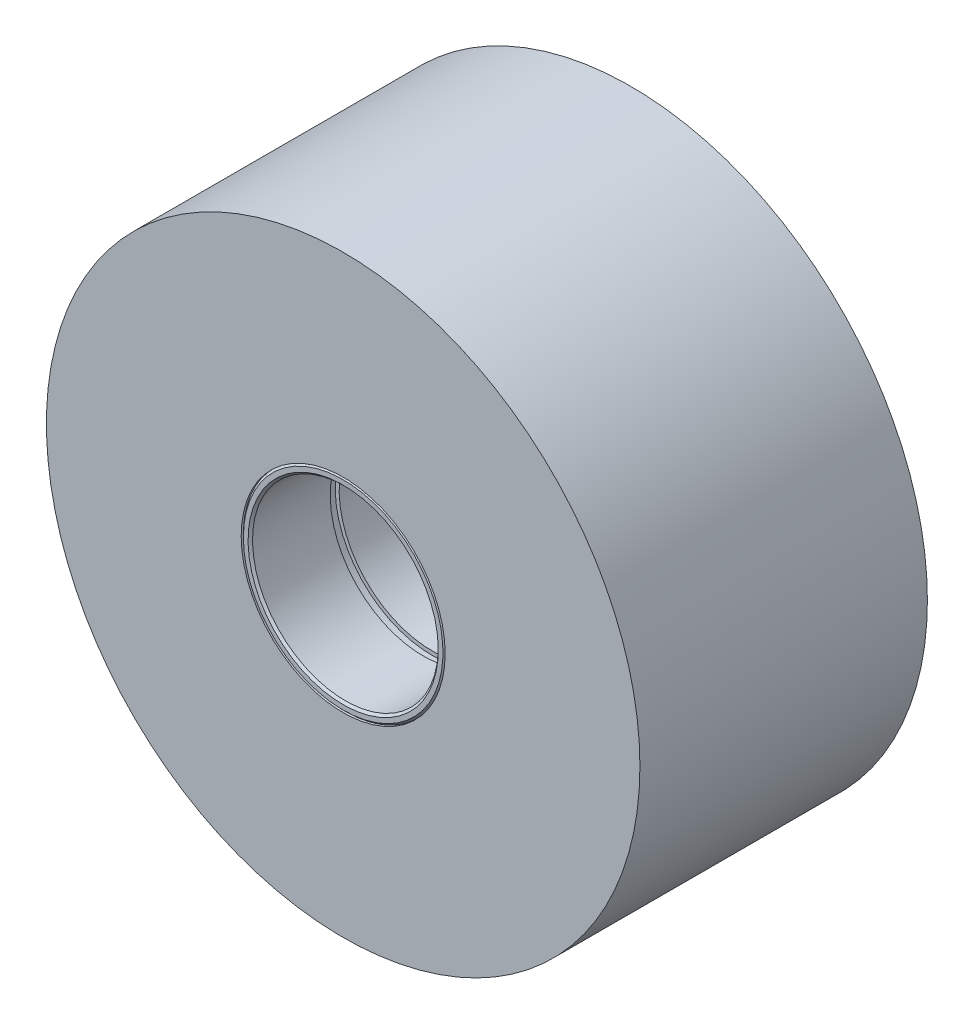
ISO-10303-21;
HEADER;
FILE_DESCRIPTION(('STEP AP214'),'2;1');
FILE_NAME('part.step','',(''),(''),'','','');
FILE_SCHEMA(('AUTOMOTIVE_DESIGN { 1 0 10303 214 1 1 1 1 }'));
ENDSEC;
DATA;
#1=APPLICATION_CONTEXT('core data for automotive mechanical design processes');
#2=APPLICATION_PROTOCOL_DEFINITION('international standard','automotive_design',2000,#1);
#3=PRODUCT_CONTEXT('',#1,'mechanical');
#4=PRODUCT('Part','Part','',(#3));
#5=PRODUCT_RELATED_PRODUCT_CATEGORY('part','',(#4));
#6=PRODUCT_DEFINITION_FORMATION('','',#4);
#7=PRODUCT_DEFINITION_CONTEXT('part definition',#1,'design');
#8=PRODUCT_DEFINITION('design','',#6,#7);
#9=PRODUCT_DEFINITION_SHAPE('','',#8);
#10=(LENGTH_UNIT() NAMED_UNIT(*) SI_UNIT(.MILLI.,.METRE.));
#11=(NAMED_UNIT(*) PLANE_ANGLE_UNIT() SI_UNIT($,.RADIAN.));
#12=(NAMED_UNIT(*) SI_UNIT($,.STERADIAN.) SOLID_ANGLE_UNIT());
#13=UNCERTAINTY_MEASURE_WITH_UNIT(LENGTH_MEASURE(1.E-05),#10,'distance_accuracy_value','');
#14=(GEOMETRIC_REPRESENTATION_CONTEXT(3) GLOBAL_UNCERTAINTY_ASSIGNED_CONTEXT((#13)) GLOBAL_UNIT_ASSIGNED_CONTEXT((#10,
#11,#12)) REPRESENTATION_CONTEXT('',''));
#15=CARTESIAN_POINT('',(0.,0.,0.));
#16=DIRECTION('',(0.,0.,1.));
#17=DIRECTION('',(1.,0.,0.));
#18=AXIS2_PLACEMENT_3D('',#15,#16,#17);
#19=CARTESIAN_POINT('',(0.,0.,0.));
#20=DIRECTION('',(0.,0.,-1.));
#21=DIRECTION('',(-1.,0.,0.));
#22=AXIS2_PLACEMENT_3D('',#19,#20,#21);
#23=CYLINDRICAL_SURFACE('',#22,17.4625);
#24=CARTESIAN_POINT('',(0.,0.,-49.2125));
#25=DIRECTION('',(0.,0.,-1.));
#26=DIRECTION('',(-1.,0.,0.));
#27=AXIS2_PLACEMENT_3D('',#24,#25,#26);
#28=CIRCLE('',#27,17.4625);
#29=CARTESIAN_POINT('',(-17.4625,0.,-49.2125));
#30=VERTEX_POINT('',#29);
#31=EDGE_CURVE('P0_E17',#30,#30,#28,.T.);
#32=ORIENTED_EDGE('',*,*,#31,.T.);
#33=EDGE_LOOP('',(#32));
#34=FACE_BOUND('',#33,.T.);
#35=CARTESIAN_POINT('',(0.,0.,0.));
#36=DIRECTION('',(0.,0.,-1.));
#37=DIRECTION('',(-1.,0.,0.));
#38=AXIS2_PLACEMENT_3D('',#35,#36,#37);
#39=CIRCLE('',#38,17.4625);
#40=CARTESIAN_POINT('',(-17.4625,0.,0.));
#41=VERTEX_POINT('',#40);
#42=EDGE_CURVE('P0_E26',#41,#41,#39,.T.);
#43=ORIENTED_EDGE('',*,*,#42,.F.);
#44=EDGE_LOOP('',(#43));
#45=FACE_BOUND('',#44,.T.);
#46=ADVANCED_FACE('P0_F14',(#34,#45),#23,.F.);
#47=CARTESIAN_POINT('',(0.,0.,-49.2125));
#48=DIRECTION('',(0.,0.,1.));
#49=DIRECTION('',(1.,0.,0.));
#50=AXIS2_PLACEMENT_3D('',#47,#48,#49);
#51=PLANE('',#50);
#52=CARTESIAN_POINT('',(0.,0.,-49.2125));
#53=DIRECTION('',(0.,0.,1.));
#54=DIRECTION('',(1.,0.,0.));
#55=AXIS2_PLACEMENT_3D('',#52,#53,#54);
#56=CIRCLE('',#55,50.8);
#57=CARTESIAN_POINT('',(50.8,0.,-49.2125));
#58=VERTEX_POINT('',#57);
#59=EDGE_CURVE('P0_E21',#58,#58,#56,.T.);
#60=ORIENTED_EDGE('',*,*,#59,.F.);
#61=EDGE_LOOP('',(#60));
#62=FACE_BOUND('',#61,.T.);
#63=ORIENTED_EDGE('',*,*,#31,.F.);
#64=EDGE_LOOP('',(#63));
#65=FACE_BOUND('',#64,.T.);
#66=ADVANCED_FACE('P0_F36',(#62,#65),#51,.F.);
#67=CARTESIAN_POINT('',(0.,0.,0.));
#68=DIRECTION('',(0.,0.,1.));
#69=DIRECTION('',(1.,0.,0.));
#70=AXIS2_PLACEMENT_3D('',#67,#68,#69);
#71=PLANE('',#70);
#72=CARTESIAN_POINT('',(0.,0.,0.));
#73=DIRECTION('',(0.,0.,1.));
#74=DIRECTION('',(1.,0.,0.));
#75=AXIS2_PLACEMENT_3D('',#72,#73,#74);
#76=CIRCLE('',#75,50.8);
#77=CARTESIAN_POINT('',(50.8,0.,0.));
#78=VERTEX_POINT('',#77);
#79=EDGE_CURVE('P0_E10',#78,#78,#76,.F.);
#80=ORIENTED_EDGE('',*,*,#79,.F.);
#81=EDGE_LOOP('',(#80));
#82=FACE_BOUND('',#81,.T.);
#83=ORIENTED_EDGE('',*,*,#42,.T.);
#84=EDGE_LOOP('',(#83));
#85=FACE_BOUND('',#84,.T.);
#86=ADVANCED_FACE('P0_F38',(#82,#85),#71,.T.);
#87=CARTESIAN_POINT('',(0.,0.,-49.2125));
#88=DIRECTION('',(0.,0.,1.));
#89=DIRECTION('',(1.,0.,0.));
#90=AXIS2_PLACEMENT_3D('',#87,#88,#89);
#91=CYLINDRICAL_SURFACE('',#90,50.8);
#92=ORIENTED_EDGE('',*,*,#79,.T.);
#93=EDGE_LOOP('',(#92));
#94=FACE_BOUND('',#93,.T.);
#95=ORIENTED_EDGE('',*,*,#59,.T.);
#96=EDGE_LOOP('',(#95));
#97=FACE_BOUND('',#96,.T.);
#98=ADVANCED_FACE('P0_F45',(#94,#97),#91,.T.);
#99=CLOSED_SHELL('',(#46,#66,#86,#98));
#100=MANIFOLD_SOLID_BREP('P0_B1',#99);
#101=CARTESIAN_POINT('',(0.,0.,-49.2125));
#102=DIRECTION('',(0.,0.,1.));
#103=DIRECTION('',(-0.923728021347068,-0.383049008063238,0.));
#104=AXIS2_PLACEMENT_3D('',#101,#102,#103);
#105=CYLINDRICAL_SURFACE('',#104,15.9004);
#106=CARTESIAN_POINT('',(0.,0.,-15.20825));
#107=DIRECTION('',(0.,0.,1.));
#108=DIRECTION('',(-0.923728021347068,-0.383049008063238,0.));
#109=AXIS2_PLACEMENT_3D('',#106,#107,#108);
#110=CIRCLE('',#109,15.9004);
#111=CARTESIAN_POINT('',(-14.6876450306269,-6.0906324478087,-15.20825));
#112=VERTEX_POINT('',#111);
#113=EDGE_CURVE('P1_E63',#112,#112,#110,.T.);
#114=ORIENTED_EDGE('',*,*,#113,.T.);
#115=EDGE_LOOP('',(#114));
#116=FACE_BOUND('',#115,.T.);
#117=CARTESIAN_POINT('',(0.,0.,-34.00425));
#118=DIRECTION('',(0.,0.,1.));
#119=DIRECTION('',(-0.923728021347068,-0.383049008063238,0.));
#120=AXIS2_PLACEMENT_3D('',#117,#118,#119);
#121=CIRCLE('',#120,15.9004);
#122=CARTESIAN_POINT('',(-14.6876450306269,-6.0906324478087,-34.00425));
#123=VERTEX_POINT('',#122);
#124=EDGE_CURVE('P1_E17',#123,#123,#121,.T.);
#125=ORIENTED_EDGE('',*,*,#124,.F.);
#126=EDGE_LOOP('',(#125));
#127=FACE_BOUND('',#126,.T.);
#128=ADVANCED_FACE('P1_F14',(#116,#127),#105,.F.);
#129=CARTESIAN_POINT('',(0.,0.,-34.00425));
#130=DIRECTION('',(0.,0.,-1.));
#131=DIRECTION('',(0.923728021347068,0.383049008063238,0.));
#132=AXIS2_PLACEMENT_3D('',#129,#130,#131);
#133=PLANE('',#132);
#134=CARTESIAN_POINT('',(0.,0.,-34.00425));
#135=DIRECTION('',(0.,0.,1.));
#136=DIRECTION('',(-0.923728021347068,-0.383049008063238,0.));
#137=AXIS2_PLACEMENT_3D('',#134,#135,#136);
#138=CIRCLE('',#137,16.5735);
#139=CARTESIAN_POINT('',(-15.3094063617956,-6.34846273513607,-34.00425));
#140=VERTEX_POINT('',#139);
#141=EDGE_CURVE('P1_E61',#140,#140,#138,.F.);
#142=ORIENTED_EDGE('',*,*,#141,.T.);
#143=EDGE_LOOP('',(#142));
#144=FACE_BOUND('',#143,.T.);
#145=ORIENTED_EDGE('',*,*,#124,.T.);
#146=EDGE_LOOP('',(#145));
#147=FACE_BOUND('',#146,.T.);
#148=ADVANCED_FACE('P1_F70',(#144,#147),#133,.T.);
#149=CARTESIAN_POINT('',(0.,0.,-15.20825));
#150=DIRECTION('',(0.,0.,-1.));
#151=DIRECTION('',(0.923728021347068,0.383049008063238,0.));
#152=AXIS2_PLACEMENT_3D('',#149,#150,#151);
#153=PLANE('',#152);
#154=CARTESIAN_POINT('',(0.,0.,-15.20825));
#155=DIRECTION('',(0.,0.,-1.));
#156=DIRECTION('',(0.923728021347068,0.383049008063238,0.));
#157=AXIS2_PLACEMENT_3D('',#154,#155,#156);
#158=CIRCLE('',#157,16.5735);
#159=CARTESIAN_POINT('',(15.3094063617956,6.34846273513607,-15.20825));
#160=VERTEX_POINT('',#159);
#161=EDGE_CURVE('P1_E58',#160,#160,#158,.F.);
#162=ORIENTED_EDGE('',*,*,#161,.T.);
#163=EDGE_LOOP('',(#162));
#164=FACE_BOUND('',#163,.T.);
#165=ORIENTED_EDGE('',*,*,#113,.F.);
#166=EDGE_LOOP('',(#165));
#167=FACE_BOUND('',#166,.T.);
#168=ADVANCED_FACE('P1_F77',(#164,#167),#153,.F.);
#169=CARTESIAN_POINT('',(0.,0.,-35.52825));
#170=DIRECTION('',(0.,0.,1.));
#171=DIRECTION('',(-0.923728021347068,-0.383049008063238,0.));
#172=AXIS2_PLACEMENT_3D('',#169,#170,#171);
#173=CYLINDRICAL_SURFACE('',#172,16.5735);
#174=ORIENTED_EDGE('',*,*,#141,.F.);
#175=EDGE_LOOP('',(#174));
#176=FACE_BOUND('',#175,.T.);
#177=CARTESIAN_POINT('',(0.,0.,-35.52825));
#178=DIRECTION('',(0.,0.,1.));
#179=DIRECTION('',(-0.923728021347068,-0.383049008063238,0.));
#180=AXIS2_PLACEMENT_3D('',#177,#178,#179);
#181=CIRCLE('',#180,16.5735);
#182=CARTESIAN_POINT('',(-15.3094063617956,-6.34846273513607,-35.52825));
#183=VERTEX_POINT('',#182);
#184=EDGE_CURVE('P1_E55',#183,#183,#181,.F.);
#185=ORIENTED_EDGE('',*,*,#184,.T.);
#186=EDGE_LOOP('',(#185));
#187=FACE_BOUND('',#186,.T.);
#188=ADVANCED_FACE('P1_F129',(#176,#187),#173,.F.);
#189=CARTESIAN_POINT('',(0.,0.,-13.68425));
#190=DIRECTION('',(0.,0.,-1.));
#191=DIRECTION('',(0.923728021347068,0.383049008063238,0.));
#192=AXIS2_PLACEMENT_3D('',#189,#190,#191);
#193=CYLINDRICAL_SURFACE('',#192,16.5735);
#194=ORIENTED_EDGE('',*,*,#161,.F.);
#195=EDGE_LOOP('',(#194));
#196=FACE_BOUND('',#195,.T.);
#197=CARTESIAN_POINT('',(0.,0.,-13.68425));
#198=DIRECTION('',(0.,0.,-1.));
#199=DIRECTION('',(0.923728021347068,0.383049008063238,0.));
#200=AXIS2_PLACEMENT_3D('',#197,#198,#199);
#201=CIRCLE('',#200,16.5735);
#202=CARTESIAN_POINT('',(15.3094063617956,6.34846273513607,-13.68425));
#203=VERTEX_POINT('',#202);
#204=EDGE_CURVE('P1_E52',#203,#203,#201,.T.);
#205=ORIENTED_EDGE('',*,*,#204,.F.);
#206=EDGE_LOOP('',(#205));
#207=FACE_BOUND('',#206,.T.);
#208=ADVANCED_FACE('P1_F125',(#196,#207),#193,.F.);
#209=CARTESIAN_POINT('',(0.,0.,-35.52825));
#210=DIRECTION('',(0.,0.,-1.));
#211=DIRECTION('',(0.923728021347068,0.383049008063238,0.));
#212=AXIS2_PLACEMENT_3D('',#209,#210,#211);
#213=PLANE('',#212);
#214=ORIENTED_EDGE('',*,*,#184,.F.);
#215=EDGE_LOOP('',(#214));
#216=FACE_BOUND('',#215,.T.);
#217=CARTESIAN_POINT('',(0.,0.,-35.52825));
#218=DIRECTION('',(0.,0.,1.));
#219=DIRECTION('',(-0.923728021347068,-0.383049008063238,0.));
#220=AXIS2_PLACEMENT_3D('',#217,#218,#219);
#221=CIRCLE('',#220,15.9004);
#222=CARTESIAN_POINT('',(-14.6876450306269,-6.0906324478087,-35.52825));
#223=VERTEX_POINT('',#222);
#224=EDGE_CURVE('P1_E49',#223,#223,#221,.F.);
#225=ORIENTED_EDGE('',*,*,#224,.T.);
#226=EDGE_LOOP('',(#225));
#227=FACE_BOUND('',#226,.T.);
#228=ADVANCED_FACE('P1_F121',(#216,#227),#213,.F.);
#229=CARTESIAN_POINT('',(0.,0.,-13.68425));
#230=DIRECTION('',(0.,0.,-1.));
#231=DIRECTION('',(0.923728021347068,0.383049008063238,0.));
#232=AXIS2_PLACEMENT_3D('',#229,#230,#231);
#233=PLANE('',#232);
#234=ORIENTED_EDGE('',*,*,#204,.T.);
#235=EDGE_LOOP('',(#234));
#236=FACE_BOUND('',#235,.T.);
#237=CARTESIAN_POINT('',(0.,0.,-13.68425));
#238=DIRECTION('',(0.,0.,1.));
#239=DIRECTION('',(-0.923728021347068,-0.383049008063238,0.));
#240=AXIS2_PLACEMENT_3D('',#237,#238,#239);
#241=CIRCLE('',#240,15.9004);
#242=CARTESIAN_POINT('',(-14.6876450306269,-6.0906324478087,-13.68425));
#243=VERTEX_POINT('',#242);
#244=EDGE_CURVE('P1_E36',#243,#243,#241,.T.);
#245=ORIENTED_EDGE('',*,*,#244,.T.);
#246=EDGE_LOOP('',(#245));
#247=FACE_BOUND('',#246,.T.);
#248=ADVANCED_FACE('P1_F117',(#236,#247),#233,.T.);
#249=CARTESIAN_POINT('',(0.,0.,-49.2125));
#250=DIRECTION('',(0.,0.,1.));
#251=DIRECTION('',(-0.923728021347068,-0.383049008063238,0.));
#252=AXIS2_PLACEMENT_3D('',#249,#250,#251);
#253=CYLINDRICAL_SURFACE('',#252,15.9004);
#254=CARTESIAN_POINT('',(0.,0.,-48.8315));
#255=DIRECTION('',(0.,0.,-1.));
#256=DIRECTION('',(0.923728021347068,0.383049008063238,0.));
#257=AXIS2_PLACEMENT_3D('',#254,#255,#256);
#258=CIRCLE('',#257,15.9004);
#259=CARTESIAN_POINT('',(14.6876450306269,6.0906324478087,-48.8315));
#260=VERTEX_POINT('',#259);
#261=EDGE_CURVE('P1_E33',#260,#260,#258,.T.);
#262=ORIENTED_EDGE('',*,*,#261,.T.);
#263=EDGE_LOOP('',(#262));
#264=FACE_BOUND('',#263,.T.);
#265=ORIENTED_EDGE('',*,*,#224,.F.);
#266=EDGE_LOOP('',(#265));
#267=FACE_BOUND('',#266,.T.);
#268=ADVANCED_FACE('P1_F113',(#264,#267),#253,.F.);
#269=CARTESIAN_POINT('',(0.,0.,-49.2125));
#270=DIRECTION('',(0.,0.,1.));
#271=DIRECTION('',(-0.923728021347068,-0.383049008063238,0.));
#272=AXIS2_PLACEMENT_3D('',#269,#270,#271);
#273=CYLINDRICAL_SURFACE('',#272,15.9004);
#274=CARTESIAN_POINT('',(0.,0.,-0.381000000000006));
#275=DIRECTION('',(0.,0.,1.));
#276=DIRECTION('',(-0.923728021347068,-0.383049008063238,0.));
#277=AXIS2_PLACEMENT_3D('',#274,#275,#276);
#278=CIRCLE('',#277,15.9004);
#279=CARTESIAN_POINT('',(-14.6876450306269,-6.0906324478087,-0.381000000000006));
#280=VERTEX_POINT('',#279);
#281=EDGE_CURVE('P1_E29',#280,#280,#278,.T.);
#282=ORIENTED_EDGE('',*,*,#281,.T.);
#283=EDGE_LOOP('',(#282));
#284=FACE_BOUND('',#283,.T.);
#285=ORIENTED_EDGE('',*,*,#244,.F.);
#286=EDGE_LOOP('',(#285));
#287=FACE_BOUND('',#286,.T.);
#288=ADVANCED_FACE('P1_F109',(#284,#287),#273,.F.);
#289=CARTESIAN_POINT('',(0.,0.,-49.2125));
#290=DIRECTION('',(0.,0.,-1.));
#291=DIRECTION('',(-0.383049008063238,0.923728021347068,0.));
#292=AXIS2_PLACEMENT_3D('',#289,#290,#291);
#293=CONICAL_SURFACE('',#292,16.2814,0.785398163397444);
#294=ORIENTED_EDGE('',*,*,#261,.F.);
#295=EDGE_LOOP('',(#294));
#296=FACE_BOUND('',#295,.T.);
#297=CARTESIAN_POINT('',(0.,0.,-49.2125));
#298=DIRECTION('',(0.,0.,-1.));
#299=DIRECTION('',(-0.383049008063238,0.923728021347068,0.));
#300=AXIS2_PLACEMENT_3D('',#297,#298,#299);
#301=CIRCLE('',#300,16.2814);
#302=CARTESIAN_POINT('',(-6.2365741198808,15.0395854067602,-49.2125));
#303=VERTEX_POINT('',#302);
#304=EDGE_CURVE('P1_E32',#303,#303,#301,.F.);
#305=ORIENTED_EDGE('',*,*,#304,.F.);
#306=EDGE_LOOP('',(#305));
#307=FACE_BOUND('',#306,.T.);
#308=ADVANCED_FACE('P1_F105',(#296,#307),#293,.F.);
#309=CARTESIAN_POINT('',(0.,0.,0.));
#310=DIRECTION('',(0.,0.,1.));
#311=DIRECTION('',(-0.923728021347068,-0.383049008063238,0.));
#312=AXIS2_PLACEMENT_3D('',#309,#310,#311);
#313=CONICAL_SURFACE('',#312,16.2814,0.785398163397444);
#314=CARTESIAN_POINT('',(0.,0.,0.));
#315=DIRECTION('',(0.,0.,1.));
#316=DIRECTION('',(-0.923728021347068,-0.383049008063238,0.));
#317=AXIS2_PLACEMENT_3D('',#314,#315,#316);
#318=CIRCLE('',#317,16.2814);
#319=CARTESIAN_POINT('',(-15.0395854067602,-6.2365741198808,0.));
#320=VERTEX_POINT('',#319);
#321=EDGE_CURVE('P1_E42',#320,#320,#318,.T.);
#322=ORIENTED_EDGE('',*,*,#321,.T.);
#323=EDGE_LOOP('',(#322));
#324=FACE_BOUND('',#323,.T.);
#325=ORIENTED_EDGE('',*,*,#281,.F.);
#326=EDGE_LOOP('',(#325));
#327=FACE_BOUND('',#326,.T.);
#328=ADVANCED_FACE('P1_F101',(#324,#327),#313,.F.);
#329=CARTESIAN_POINT('',(0.,0.,-49.2125));
#330=DIRECTION('',(0.,0.,-1.));
#331=DIRECTION('',(0.923728021347068,0.383049008063238,0.));
#332=AXIS2_PLACEMENT_3D('',#329,#330,#331);
#333=PLANE('',#332);
#334=CARTESIAN_POINT('',(0.,0.,-49.2125));
#335=DIRECTION('',(0.,0.,1.));
#336=DIRECTION('',(0.383049008063238,-0.923728021347068,0.));
#337=AXIS2_PLACEMENT_3D('',#334,#335,#336);
#338=CIRCLE('',#337,17.0815);
#339=CARTESIAN_POINT('',(6.54305163123219,-15.7786601966399,-49.2125));
#340=VERTEX_POINT('',#339);
#341=EDGE_CURVE('P1_E39',#340,#340,#338,.T.);
#342=ORIENTED_EDGE('',*,*,#341,.F.);
#343=EDGE_LOOP('',(#342));
#344=FACE_BOUND('',#343,.T.);
#345=ORIENTED_EDGE('',*,*,#304,.T.);
#346=EDGE_LOOP('',(#345));
#347=FACE_BOUND('',#346,.T.);
#348=ADVANCED_FACE('P1_F97',(#344,#347),#333,.T.);
#349=CARTESIAN_POINT('',(0.,0.,0.));
#350=DIRECTION('',(0.,0.,-1.));
#351=DIRECTION('',(0.923728021347068,0.383049008063238,0.));
#352=AXIS2_PLACEMENT_3D('',#349,#350,#351);
#353=PLANE('',#352);
#354=CARTESIAN_POINT('',(0.,0.,0.));
#355=DIRECTION('',(0.,0.,-1.));
#356=DIRECTION('',(-0.383049008063238,0.923728021347068,0.));
#357=AXIS2_PLACEMENT_3D('',#354,#355,#356);
#358=CIRCLE('',#357,17.0815);
#359=CARTESIAN_POINT('',(-6.54305163123219,15.7786601966399,0.));
#360=VERTEX_POINT('',#359);
#361=EDGE_CURVE('P1_E26',#360,#360,#358,.T.);
#362=ORIENTED_EDGE('',*,*,#361,.F.);
#363=EDGE_LOOP('',(#362));
#364=FACE_BOUND('',#363,.T.);
#365=ORIENTED_EDGE('',*,*,#321,.F.);
#366=EDGE_LOOP('',(#365));
#367=FACE_BOUND('',#366,.T.);
#368=ADVANCED_FACE('P1_F93',(#364,#367),#353,.F.);
#369=CARTESIAN_POINT('',(0.,0.,-48.8315));
#370=DIRECTION('',(0.,0.,1.));
#371=DIRECTION('',(0.383049008063238,-0.923728021347068,0.));
#372=AXIS2_PLACEMENT_3D('',#369,#370,#371);
#373=CONICAL_SURFACE('',#372,17.4625,0.785398163397444);
#374=CARTESIAN_POINT('',(0.,0.,-48.8315));
#375=DIRECTION('',(0.,0.,1.));
#376=DIRECTION('',(-0.923728021347068,-0.383049008063238,0.));
#377=AXIS2_PLACEMENT_3D('',#374,#375,#376);
#378=CIRCLE('',#377,17.4625);
#379=CARTESIAN_POINT('',(-16.1306005727732,-6.68899330330429,-48.8315));
#380=VERTEX_POINT('',#379);
#381=EDGE_CURVE('P1_E21',#380,#380,#378,.T.);
#382=ORIENTED_EDGE('',*,*,#381,.F.);
#383=EDGE_LOOP('',(#382));
#384=FACE_BOUND('',#383,.T.);
#385=ORIENTED_EDGE('',*,*,#341,.T.);
#386=EDGE_LOOP('',(#385));
#387=FACE_BOUND('',#386,.T.);
#388=ADVANCED_FACE('P1_F86',(#384,#387),#373,.T.);
#389=CARTESIAN_POINT('',(0.,0.,-0.381000000000006));
#390=DIRECTION('',(0.,0.,-1.));
#391=DIRECTION('',(-0.383049008063238,0.923728021347068,0.));
#392=AXIS2_PLACEMENT_3D('',#389,#390,#391);
#393=CONICAL_SURFACE('',#392,17.4625,0.785398163397444);
#394=CARTESIAN_POINT('',(0.,0.,-0.381000000000006));
#395=DIRECTION('',(0.,0.,1.));
#396=DIRECTION('',(-0.923728021347068,-0.383049008063238,0.));
#397=AXIS2_PLACEMENT_3D('',#394,#395,#396);
#398=CIRCLE('',#397,17.4625);
#399=CARTESIAN_POINT('',(-16.1306005727732,-6.68899330330429,-0.381000000000006));
#400=VERTEX_POINT('',#399);
#401=EDGE_CURVE('P1_E10',#400,#400,#398,.F.);
#402=ORIENTED_EDGE('',*,*,#401,.F.);
#403=EDGE_LOOP('',(#402));
#404=FACE_BOUND('',#403,.T.);
#405=ORIENTED_EDGE('',*,*,#361,.T.);
#406=EDGE_LOOP('',(#405));
#407=FACE_BOUND('',#406,.T.);
#408=ADVANCED_FACE('P1_F81',(#404,#407),#393,.T.);
#409=CARTESIAN_POINT('',(0.,0.,-49.2125));
#410=DIRECTION('',(0.,0.,1.));
#411=DIRECTION('',(-0.923728021347068,-0.383049008063238,0.));
#412=AXIS2_PLACEMENT_3D('',#409,#410,#411);
#413=CYLINDRICAL_SURFACE('',#412,17.4625);
#414=ORIENTED_EDGE('',*,*,#401,.T.);
#415=EDGE_LOOP('',(#414));
#416=FACE_BOUND('',#415,.T.);
#417=ORIENTED_EDGE('',*,*,#381,.T.);
#418=EDGE_LOOP('',(#417));
#419=FACE_BOUND('',#418,.T.);
#420=ADVANCED_FACE('P1_F79',(#416,#419),#413,.T.);
#421=CLOSED_SHELL('',(#128,#148,#168,#188,#208,#228,#248,#268,#288,#308,#328,#348,#368,#388,
#408,#420));
#422=MANIFOLD_SOLID_BREP('P1_B1',#421);
#423=ADVANCED_BREP_SHAPE_REPRESENTATION('',(#18,#100,#422),#14);
#424=SHAPE_DEFINITION_REPRESENTATION(#9,#423);
ENDSEC;
END-ISO-10303-21;
